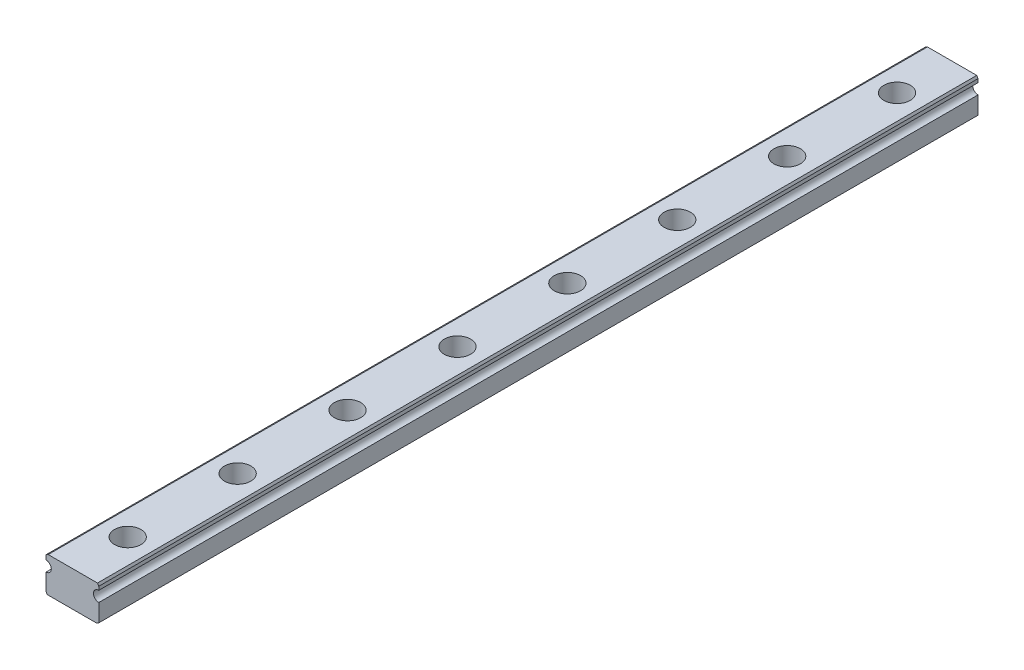
ISO-10303-21;
HEADER;
FILE_DESCRIPTION(('STEP AP214'),'2;1');
FILE_NAME('part.step','',(''),(''),'','','');
FILE_SCHEMA(('AUTOMOTIVE_DESIGN { 1 0 10303 214 1 1 1 1 }'));
ENDSEC;
DATA;
#1=APPLICATION_CONTEXT('core data for automotive mechanical design processes');
#2=APPLICATION_PROTOCOL_DEFINITION('international standard','automotive_design',2000,#1);
#3=PRODUCT_CONTEXT('',#1,'mechanical');
#4=PRODUCT('Part','Part','',(#3));
#5=PRODUCT_RELATED_PRODUCT_CATEGORY('part','',(#4));
#6=PRODUCT_DEFINITION_FORMATION('','',#4);
#7=PRODUCT_DEFINITION_CONTEXT('part definition',#1,'design');
#8=PRODUCT_DEFINITION('design','',#6,#7);
#9=PRODUCT_DEFINITION_SHAPE('','',#8);
#10=(LENGTH_UNIT() NAMED_UNIT(*) SI_UNIT(.MILLI.,.METRE.));
#11=(NAMED_UNIT(*) PLANE_ANGLE_UNIT() SI_UNIT($,.RADIAN.));
#12=(NAMED_UNIT(*) SI_UNIT($,.STERADIAN.) SOLID_ANGLE_UNIT());
#13=UNCERTAINTY_MEASURE_WITH_UNIT(LENGTH_MEASURE(1.E-05),#10,'distance_accuracy_value','');
#14=(GEOMETRIC_REPRESENTATION_CONTEXT(3) GLOBAL_UNCERTAINTY_ASSIGNED_CONTEXT((#13)) GLOBAL_UNIT_ASSIGNED_CONTEXT((#10,
#11,#12)) REPRESENTATION_CONTEXT('',''));
#15=CARTESIAN_POINT('',(0.,0.,0.));
#16=DIRECTION('',(0.,0.,1.));
#17=DIRECTION('',(1.,0.,0.));
#18=AXIS2_PLACEMENT_3D('',#15,#16,#17);
#19=CARTESIAN_POINT('',(0.0924546286147632,-4.001,-87.5));
#20=DIRECTION('',(0.,1.,0.));
#21=DIRECTION('',(0.,0.,1.));
#22=AXIS2_PLACEMENT_3D('',#19,#20,#21);
#23=CYLINDRICAL_SURFACE('',#22,1.75);
#24=CARTESIAN_POINT('',(0.0924546286147632,-4.,-87.5));
#25=DIRECTION('',(0.,1.,0.));
#26=DIRECTION('',(0.,0.,1.));
#27=AXIS2_PLACEMENT_3D('',#24,#25,#26);
#28=CIRCLE('',#27,1.75);
#29=CARTESIAN_POINT('',(0.0924546286147632,-4.,-85.75));
#30=VERTEX_POINT('',#29);
#31=EDGE_CURVE('E244',#30,#30,#28,.F.);
#32=ORIENTED_EDGE('',*,*,#31,.T.);
#33=EDGE_LOOP('',(#32));
#34=FACE_BOUND('',#33,.T.);
#35=CARTESIAN_POINT('',(0.0924546286147632,-0.5,-87.5));
#36=DIRECTION('',(0.,1.,0.));
#37=DIRECTION('',(0.,0.,1.));
#38=AXIS2_PLACEMENT_3D('',#35,#36,#37);
#39=CIRCLE('',#38,1.75);
#40=CARTESIAN_POINT('',(0.0924546286147632,-0.5,-85.75));
#41=VERTEX_POINT('',#40);
#42=EDGE_CURVE('E43',#41,#41,#39,.F.);
#43=ORIENTED_EDGE('',*,*,#42,.F.);
#44=EDGE_LOOP('',(#43));
#45=FACE_BOUND('',#44,.T.);
#46=ADVANCED_FACE('F38',(#34,#45),#23,.F.);
#47=CARTESIAN_POINT('',(0.0924546286147632,-4.001,-62.5));
#48=DIRECTION('',(0.,1.,0.));
#49=DIRECTION('',(0.,0.,1.));
#50=AXIS2_PLACEMENT_3D('',#47,#48,#49);
#51=CYLINDRICAL_SURFACE('',#50,1.75);
#52=CARTESIAN_POINT('',(0.0924546286147632,-4.,-62.5));
#53=DIRECTION('',(0.,1.,0.));
#54=DIRECTION('',(0.,0.,1.));
#55=AXIS2_PLACEMENT_3D('',#52,#53,#54);
#56=CIRCLE('',#55,1.75);
#57=CARTESIAN_POINT('',(0.0924546286147632,-4.,-60.75));
#58=VERTEX_POINT('',#57);
#59=EDGE_CURVE('E248',#58,#58,#56,.F.);
#60=ORIENTED_EDGE('',*,*,#59,.T.);
#61=EDGE_LOOP('',(#60));
#62=FACE_BOUND('',#61,.T.);
#63=CARTESIAN_POINT('',(0.0924546286147632,-0.5,-62.5));
#64=DIRECTION('',(0.,1.,0.));
#65=DIRECTION('',(0.,0.,1.));
#66=AXIS2_PLACEMENT_3D('',#63,#64,#65);
#67=CIRCLE('',#66,1.75);
#68=CARTESIAN_POINT('',(0.0924546286147632,-0.5,-60.75));
#69=VERTEX_POINT('',#68);
#70=EDGE_CURVE('E239',#69,#69,#67,.F.);
#71=ORIENTED_EDGE('',*,*,#70,.F.);
#72=EDGE_LOOP('',(#71));
#73=FACE_BOUND('',#72,.T.);
#74=ADVANCED_FACE('F321',(#62,#73),#51,.F.);
#75=CARTESIAN_POINT('',(0.0924546286147632,-4.001,-37.5));
#76=DIRECTION('',(0.,1.,0.));
#77=DIRECTION('',(0.,0.,1.));
#78=AXIS2_PLACEMENT_3D('',#75,#76,#77);
#79=CYLINDRICAL_SURFACE('',#78,1.75);
#80=CARTESIAN_POINT('',(0.0924546286147632,-4.,-37.5));
#81=DIRECTION('',(0.,1.,0.));
#82=DIRECTION('',(0.,0.,1.));
#83=AXIS2_PLACEMENT_3D('',#80,#81,#82);
#84=CIRCLE('',#83,1.75);
#85=CARTESIAN_POINT('',(0.0924546286147632,-4.,-35.75));
#86=VERTEX_POINT('',#85);
#87=EDGE_CURVE('E253',#86,#86,#84,.F.);
#88=ORIENTED_EDGE('',*,*,#87,.T.);
#89=EDGE_LOOP('',(#88));
#90=FACE_BOUND('',#89,.T.);
#91=CARTESIAN_POINT('',(0.0924546286147632,-0.5,-37.5));
#92=DIRECTION('',(0.,1.,0.));
#93=DIRECTION('',(0.,0.,1.));
#94=AXIS2_PLACEMENT_3D('',#91,#92,#93);
#95=CIRCLE('',#94,1.75);
#96=CARTESIAN_POINT('',(0.0924546286147632,-0.5,-35.75));
#97=VERTEX_POINT('',#96);
#98=EDGE_CURVE('E237',#97,#97,#95,.F.);
#99=ORIENTED_EDGE('',*,*,#98,.F.);
#100=EDGE_LOOP('',(#99));
#101=FACE_BOUND('',#100,.T.);
#102=ADVANCED_FACE('F326',(#90,#101),#79,.F.);
#103=CARTESIAN_POINT('',(0.0924546286147632,-4.001,-12.5));
#104=DIRECTION('',(0.,1.,0.));
#105=DIRECTION('',(0.,0.,1.));
#106=AXIS2_PLACEMENT_3D('',#103,#104,#105);
#107=CYLINDRICAL_SURFACE('',#106,1.75);
#108=CARTESIAN_POINT('',(0.0924546286147632,-4.,-12.5));
#109=DIRECTION('',(0.,1.,0.));
#110=DIRECTION('',(0.,0.,1.));
#111=AXIS2_PLACEMENT_3D('',#108,#109,#110);
#112=CIRCLE('',#111,1.75);
#113=CARTESIAN_POINT('',(0.0924546286147632,-4.,-10.75));
#114=VERTEX_POINT('',#113);
#115=EDGE_CURVE('E721',#114,#114,#112,.F.);
#116=ORIENTED_EDGE('',*,*,#115,.T.);
#117=EDGE_LOOP('',(#116));
#118=FACE_BOUND('',#117,.T.);
#119=CARTESIAN_POINT('',(0.0924546286147632,-0.5,-12.5));
#120=DIRECTION('',(0.,1.,0.));
#121=DIRECTION('',(0.,0.,1.));
#122=AXIS2_PLACEMENT_3D('',#119,#120,#121);
#123=CIRCLE('',#122,1.75);
#124=CARTESIAN_POINT('',(0.0924546286147632,-0.5,-10.75));
#125=VERTEX_POINT('',#124);
#126=EDGE_CURVE('E234',#125,#125,#123,.F.);
#127=ORIENTED_EDGE('',*,*,#126,.F.);
#128=EDGE_LOOP('',(#127));
#129=FACE_BOUND('',#128,.T.);
#130=ADVANCED_FACE('F605',(#118,#129),#107,.F.);
#131=CARTESIAN_POINT('',(0.0924546286147632,-4.001,12.5));
#132=DIRECTION('',(0.,1.,0.));
#133=DIRECTION('',(0.,0.,1.));
#134=AXIS2_PLACEMENT_3D('',#131,#132,#133);
#135=CYLINDRICAL_SURFACE('',#134,1.75);
#136=CARTESIAN_POINT('',(0.0924546286147632,-4.,12.5));
#137=DIRECTION('',(0.,1.,0.));
#138=DIRECTION('',(0.,0.,1.));
#139=AXIS2_PLACEMENT_3D('',#136,#137,#138);
#140=CIRCLE('',#139,1.75);
#141=CARTESIAN_POINT('',(0.0924546286147632,-4.,14.25));
#142=VERTEX_POINT('',#141);
#143=EDGE_CURVE('E713',#142,#142,#140,.F.);
#144=ORIENTED_EDGE('',*,*,#143,.T.);
#145=EDGE_LOOP('',(#144));
#146=FACE_BOUND('',#145,.T.);
#147=CARTESIAN_POINT('',(0.0924546286147632,-0.5,12.5));
#148=DIRECTION('',(0.,1.,0.));
#149=DIRECTION('',(0.,0.,1.));
#150=AXIS2_PLACEMENT_3D('',#147,#148,#149);
#151=CIRCLE('',#150,1.75);
#152=CARTESIAN_POINT('',(0.0924546286147632,-0.5,14.25));
#153=VERTEX_POINT('',#152);
#154=EDGE_CURVE('E231',#153,#153,#151,.F.);
#155=ORIENTED_EDGE('',*,*,#154,.F.);
#156=EDGE_LOOP('',(#155));
#157=FACE_BOUND('',#156,.T.);
#158=ADVANCED_FACE('F614',(#146,#157),#135,.F.);
#159=CARTESIAN_POINT('',(0.0924546286147632,-4.001,37.5));
#160=DIRECTION('',(0.,1.,0.));
#161=DIRECTION('',(0.,0.,1.));
#162=AXIS2_PLACEMENT_3D('',#159,#160,#161);
#163=CYLINDRICAL_SURFACE('',#162,1.75);
#164=CARTESIAN_POINT('',(0.0924546286147632,-4.,37.5));
#165=DIRECTION('',(0.,1.,0.));
#166=DIRECTION('',(0.,0.,1.));
#167=AXIS2_PLACEMENT_3D('',#164,#165,#166);
#168=CIRCLE('',#167,1.75);
#169=CARTESIAN_POINT('',(0.0924546286147632,-4.,39.25));
#170=VERTEX_POINT('',#169);
#171=EDGE_CURVE('E710',#170,#170,#168,.F.);
#172=ORIENTED_EDGE('',*,*,#171,.T.);
#173=EDGE_LOOP('',(#172));
#174=FACE_BOUND('',#173,.T.);
#175=CARTESIAN_POINT('',(0.0924546286147632,-0.5,37.5));
#176=DIRECTION('',(0.,1.,0.));
#177=DIRECTION('',(0.,0.,1.));
#178=AXIS2_PLACEMENT_3D('',#175,#176,#177);
#179=CIRCLE('',#178,1.75);
#180=CARTESIAN_POINT('',(0.0924546286147632,-0.5,39.25));
#181=VERTEX_POINT('',#180);
#182=EDGE_CURVE('E227',#181,#181,#179,.F.);
#183=ORIENTED_EDGE('',*,*,#182,.F.);
#184=EDGE_LOOP('',(#183));
#185=FACE_BOUND('',#184,.T.);
#186=ADVANCED_FACE('F624',(#174,#185),#163,.F.);
#187=CARTESIAN_POINT('',(0.0924546286147632,-4.001,62.5));
#188=DIRECTION('',(0.,1.,0.));
#189=DIRECTION('',(0.,0.,1.));
#190=AXIS2_PLACEMENT_3D('',#187,#188,#189);
#191=CYLINDRICAL_SURFACE('',#190,1.75);
#192=CARTESIAN_POINT('',(0.0924546286147632,-4.,62.5));
#193=DIRECTION('',(0.,1.,0.));
#194=DIRECTION('',(0.,0.,1.));
#195=AXIS2_PLACEMENT_3D('',#192,#193,#194);
#196=CIRCLE('',#195,1.75);
#197=CARTESIAN_POINT('',(0.0924546286147632,-4.,64.25));
#198=VERTEX_POINT('',#197);
#199=EDGE_CURVE('E262',#198,#198,#196,.F.);
#200=ORIENTED_EDGE('',*,*,#199,.T.);
#201=EDGE_LOOP('',(#200));
#202=FACE_BOUND('',#201,.T.);
#203=CARTESIAN_POINT('',(0.0924546286147632,-0.5,62.5));
#204=DIRECTION('',(0.,1.,0.));
#205=DIRECTION('',(0.,0.,1.));
#206=AXIS2_PLACEMENT_3D('',#203,#204,#205);
#207=CIRCLE('',#206,1.75);
#208=CARTESIAN_POINT('',(0.0924546286147632,-0.5,64.25));
#209=VERTEX_POINT('',#208);
#210=EDGE_CURVE('E224',#209,#209,#207,.F.);
#211=ORIENTED_EDGE('',*,*,#210,.F.);
#212=EDGE_LOOP('',(#211));
#213=FACE_BOUND('',#212,.T.);
#214=ADVANCED_FACE('F343',(#202,#213),#191,.F.);
#215=CARTESIAN_POINT('',(0.0924546286147632,-4.001,87.5));
#216=DIRECTION('',(0.,1.,0.));
#217=DIRECTION('',(0.,0.,1.));
#218=AXIS2_PLACEMENT_3D('',#215,#216,#217);
#219=CYLINDRICAL_SURFACE('',#218,1.75);
#220=CARTESIAN_POINT('',(0.0924546286147632,-4.,87.5));
#221=DIRECTION('',(0.,1.,0.));
#222=DIRECTION('',(0.,0.,1.));
#223=AXIS2_PLACEMENT_3D('',#220,#221,#222);
#224=CIRCLE('',#223,1.75);
#225=CARTESIAN_POINT('',(0.0924546286147632,-4.,89.25));
#226=VERTEX_POINT('',#225);
#227=EDGE_CURVE('E168',#226,#226,#224,.F.);
#228=ORIENTED_EDGE('',*,*,#227,.T.);
#229=EDGE_LOOP('',(#228));
#230=FACE_BOUND('',#229,.T.);
#231=CARTESIAN_POINT('',(0.0924546286147632,-0.5,87.5));
#232=DIRECTION('',(0.,1.,0.));
#233=DIRECTION('',(0.,0.,1.));
#234=AXIS2_PLACEMENT_3D('',#231,#232,#233);
#235=CIRCLE('',#234,1.75);
#236=CARTESIAN_POINT('',(0.0924546286147632,-0.5,89.25));
#237=VERTEX_POINT('',#236);
#238=EDGE_CURVE('E220',#237,#237,#235,.F.);
#239=ORIENTED_EDGE('',*,*,#238,.F.);
#240=EDGE_LOOP('',(#239));
#241=FACE_BOUND('',#240,.T.);
#242=ADVANCED_FACE('F316',(#230,#241),#219,.F.);
#243=CARTESIAN_POINT('',(6.,2.7,100.));
#244=DIRECTION('',(-1.,0.,0.));
#245=DIRECTION('',(0.,0.,1.));
#246=AXIS2_PLACEMENT_3D('',#243,#244,#245);
#247=PLANE('',#246);
#248=DIRECTION('',(0.,1.,0.));
#249=VECTOR('',#248,1.);
#250=CARTESIAN_POINT('',(6.,2.7,-100.));
#251=LINE('',#250,#249);
#252=CARTESIAN_POINT('',(6.,2.7,-100.));
#253=VERTEX_POINT('',#252);
#254=CARTESIAN_POINT('',(6.,3.5,-100.));
#255=VERTEX_POINT('',#254);
#256=EDGE_CURVE('E164',#253,#255,#251,.T.);
#257=ORIENTED_EDGE('',*,*,#256,.T.);
#258=DIRECTION('',(0.,0.,1.));
#259=VECTOR('',#258,1.);
#260=CARTESIAN_POINT('',(6.,3.5,100.));
#261=LINE('',#260,#259);
#262=CARTESIAN_POINT('',(6.,3.5,100.));
#263=VERTEX_POINT('',#262);
#264=EDGE_CURVE('E48',#255,#263,#261,.T.);
#265=ORIENTED_EDGE('',*,*,#264,.T.);
#266=DIRECTION('',(0.,1.,0.));
#267=VECTOR('',#266,1.);
#268=CARTESIAN_POINT('',(6.,2.7,100.));
#269=LINE('',#268,#267);
#270=CARTESIAN_POINT('',(6.,2.7,100.));
#271=VERTEX_POINT('',#270);
#272=EDGE_CURVE('E184',#271,#263,#269,.T.);
#273=ORIENTED_EDGE('',*,*,#272,.F.);
#274=DIRECTION('',(0.,0.,-1.));
#275=VECTOR('',#274,1.);
#276=CARTESIAN_POINT('',(6.,2.7,100.));
#277=LINE('',#276,#275);
#278=EDGE_CURVE('E163',#271,#253,#277,.T.);
#279=ORIENTED_EDGE('',*,*,#278,.T.);
#280=EDGE_LOOP('',(#257,#265,#273,#279));
#281=FACE_BOUND('',#280,.T.);
#282=ADVANCED_FACE('F303',(#281),#247,.F.);
#283=CARTESIAN_POINT('',(-6.,4.,100.));
#284=DIRECTION('',(0.,-1.,0.));
#285=DIRECTION('',(0.,0.,-1.));
#286=AXIS2_PLACEMENT_3D('',#283,#284,#285);
#287=PLANE('',#286);
#288=CARTESIAN_POINT('',(0.0924546286147632,4.,62.5));
#289=DIRECTION('',(0.,1.,0.));
#290=DIRECTION('',(0.,0.,1.));
#291=AXIS2_PLACEMENT_3D('',#288,#289,#290);
#292=CIRCLE('',#291,3.);
#293=CARTESIAN_POINT('',(0.0924546286147632,4.,65.5));
#294=VERTEX_POINT('',#293);
#295=EDGE_CURVE('E782',#294,#294,#292,.T.);
#296=ORIENTED_EDGE('',*,*,#295,.F.);
#297=EDGE_LOOP('',(#296));
#298=FACE_BOUND('',#297,.T.);
#299=CARTESIAN_POINT('',(0.0924546286147632,4.,37.5));
#300=DIRECTION('',(0.,1.,0.));
#301=DIRECTION('',(0.,0.,1.));
#302=AXIS2_PLACEMENT_3D('',#299,#300,#301);
#303=CIRCLE('',#302,3.);
#304=CARTESIAN_POINT('',(0.0924546286147632,4.,40.5));
#305=VERTEX_POINT('',#304);
#306=EDGE_CURVE('E776',#305,#305,#303,.T.);
#307=ORIENTED_EDGE('',*,*,#306,.F.);
#308=EDGE_LOOP('',(#307));
#309=FACE_BOUND('',#308,.T.);
#310=CARTESIAN_POINT('',(0.0924546286147632,4.,12.5));
#311=DIRECTION('',(0.,1.,0.));
#312=DIRECTION('',(0.,0.,1.));
#313=AXIS2_PLACEMENT_3D('',#310,#311,#312);
#314=CIRCLE('',#313,3.);
#315=CARTESIAN_POINT('',(0.0924546286147632,4.,15.5));
#316=VERTEX_POINT('',#315);
#317=EDGE_CURVE('E770',#316,#316,#314,.T.);
#318=ORIENTED_EDGE('',*,*,#317,.F.);
#319=EDGE_LOOP('',(#318));
#320=FACE_BOUND('',#319,.T.);
#321=CARTESIAN_POINT('',(0.0924546286147632,4.,-12.5));
#322=DIRECTION('',(0.,1.,0.));
#323=DIRECTION('',(0.,0.,1.));
#324=AXIS2_PLACEMENT_3D('',#321,#322,#323);
#325=CIRCLE('',#324,3.);
#326=CARTESIAN_POINT('',(0.0924546286147632,4.,-9.49999999999999));
#327=VERTEX_POINT('',#326);
#328=EDGE_CURVE('E764',#327,#327,#325,.T.);
#329=ORIENTED_EDGE('',*,*,#328,.F.);
#330=EDGE_LOOP('',(#329));
#331=FACE_BOUND('',#330,.T.);
#332=CARTESIAN_POINT('',(0.0924546286147632,4.,-37.5));
#333=DIRECTION('',(0.,1.,0.));
#334=DIRECTION('',(0.,0.,1.));
#335=AXIS2_PLACEMENT_3D('',#332,#333,#334);
#336=CIRCLE('',#335,3.);
#337=CARTESIAN_POINT('',(0.0924546286147632,4.,-34.5));
#338=VERTEX_POINT('',#337);
#339=EDGE_CURVE('E758',#338,#338,#336,.T.);
#340=ORIENTED_EDGE('',*,*,#339,.F.);
#341=EDGE_LOOP('',(#340));
#342=FACE_BOUND('',#341,.T.);
#343=CARTESIAN_POINT('',(0.0924546286147632,4.,-62.5));
#344=DIRECTION('',(0.,1.,0.));
#345=DIRECTION('',(0.,0.,1.));
#346=AXIS2_PLACEMENT_3D('',#343,#344,#345);
#347=CIRCLE('',#346,3.);
#348=CARTESIAN_POINT('',(0.0924546286147632,4.,-59.5));
#349=VERTEX_POINT('',#348);
#350=EDGE_CURVE('E752',#349,#349,#347,.T.);
#351=ORIENTED_EDGE('',*,*,#350,.F.);
#352=EDGE_LOOP('',(#351));
#353=FACE_BOUND('',#352,.T.);
#354=CARTESIAN_POINT('',(0.0924546286147632,4.,-87.5));
#355=DIRECTION('',(0.,1.,0.));
#356=DIRECTION('',(0.,0.,1.));
#357=AXIS2_PLACEMENT_3D('',#354,#355,#356);
#358=CIRCLE('',#357,3.);
#359=CARTESIAN_POINT('',(0.0924546286147632,4.,-84.5));
#360=VERTEX_POINT('',#359);
#361=EDGE_CURVE('E716',#360,#360,#358,.T.);
#362=ORIENTED_EDGE('',*,*,#361,.F.);
#363=EDGE_LOOP('',(#362));
#364=FACE_BOUND('',#363,.T.);
#365=CARTESIAN_POINT('',(0.0924546286147632,4.,87.5));
#366=DIRECTION('',(0.,1.,0.));
#367=DIRECTION('',(0.,0.,1.));
#368=AXIS2_PLACEMENT_3D('',#365,#366,#367);
#369=CIRCLE('',#368,3.);
#370=CARTESIAN_POINT('',(0.0924546286147632,4.,90.5));
#371=VERTEX_POINT('',#370);
#372=EDGE_CURVE('E259',#371,#371,#369,.T.);
#373=ORIENTED_EDGE('',*,*,#372,.F.);
#374=EDGE_LOOP('',(#373));
#375=FACE_BOUND('',#374,.T.);
#376=DIRECTION('',(-1.,0.,0.));
#377=VECTOR('',#376,1.);
#378=CARTESIAN_POINT('',(-6.,4.,100.));
#379=LINE('',#378,#377);
#380=CARTESIAN_POINT('',(5.71132486540518,4.,100.));
#381=VERTEX_POINT('',#380);
#382=CARTESIAN_POINT('',(-5.5,4.,100.));
#383=VERTEX_POINT('',#382);
#384=EDGE_CURVE('E137',#381,#383,#379,.T.);
#385=ORIENTED_EDGE('',*,*,#384,.F.);
#386=DIRECTION('',(0.,0.,-1.));
#387=VECTOR('',#386,1.);
#388=CARTESIAN_POINT('',(5.71132486540518,4.,100.));
#389=LINE('',#388,#387);
#390=CARTESIAN_POINT('',(5.71132486540518,4.,-100.));
#391=VERTEX_POINT('',#390);
#392=EDGE_CURVE('E216',#381,#391,#389,.T.);
#393=ORIENTED_EDGE('',*,*,#392,.T.);
#394=DIRECTION('',(-1.,0.,0.));
#395=VECTOR('',#394,1.);
#396=CARTESIAN_POINT('',(-6.,4.,-100.));
#397=LINE('',#396,#395);
#398=CARTESIAN_POINT('',(-5.5,4.,-100.));
#399=VERTEX_POINT('',#398);
#400=EDGE_CURVE('E167',#391,#399,#397,.T.);
#401=ORIENTED_EDGE('',*,*,#400,.T.);
#402=DIRECTION('',(0.,0.,1.));
#403=VECTOR('',#402,1.);
#404=CARTESIAN_POINT('',(-5.5,4.,100.));
#405=LINE('',#404,#403);
#406=EDGE_CURVE('E214',#399,#383,#405,.T.);
#407=ORIENTED_EDGE('',*,*,#406,.T.);
#408=EDGE_LOOP('',(#385,#393,#401,#407));
#409=FACE_BOUND('',#408,.T.);
#410=ADVANCED_FACE('F307',(#298,#309,#320,#331,#342,#353,#364,#375,#409),#287,.F.);
#411=CARTESIAN_POINT('',(-6.,2.7,100.));
#412=DIRECTION('',(1.,0.,0.));
#413=DIRECTION('',(0.,0.,-1.));
#414=AXIS2_PLACEMENT_3D('',#411,#412,#413);
#415=PLANE('',#414);
#416=DIRECTION('',(0.,-1.,0.));
#417=VECTOR('',#416,1.);
#418=CARTESIAN_POINT('',(-6.,2.7,100.));
#419=LINE('',#418,#417);
#420=CARTESIAN_POINT('',(-6.,3.71132486540519,100.));
#421=VERTEX_POINT('',#420);
#422=CARTESIAN_POINT('',(-6.,2.7,100.));
#423=VERTEX_POINT('',#422);
#424=EDGE_CURVE('E128',#421,#423,#419,.T.);
#425=ORIENTED_EDGE('',*,*,#424,.F.);
#426=DIRECTION('',(0.,0.,-1.));
#427=VECTOR('',#426,1.);
#428=CARTESIAN_POINT('',(-6.,3.71132486540519,100.));
#429=LINE('',#428,#427);
#430=CARTESIAN_POINT('',(-6.,3.71132486540519,-100.));
#431=VERTEX_POINT('',#430);
#432=EDGE_CURVE('E11',#421,#431,#429,.T.);
#433=ORIENTED_EDGE('',*,*,#432,.T.);
#434=DIRECTION('',(0.,-1.,0.));
#435=VECTOR('',#434,1.);
#436=CARTESIAN_POINT('',(-6.,2.7,-100.));
#437=LINE('',#436,#435);
#438=CARTESIAN_POINT('',(-6.,2.7,-100.));
#439=VERTEX_POINT('',#438);
#440=EDGE_CURVE('E143',#431,#439,#437,.T.);
#441=ORIENTED_EDGE('',*,*,#440,.T.);
#442=DIRECTION('',(0.,0.,-1.));
#443=VECTOR('',#442,1.);
#444=CARTESIAN_POINT('',(-6.,2.7,100.));
#445=LINE('',#444,#443);
#446=EDGE_CURVE('E140',#423,#439,#445,.T.);
#447=ORIENTED_EDGE('',*,*,#446,.F.);
#448=EDGE_LOOP('',(#425,#433,#441,#447));
#449=FACE_BOUND('',#448,.T.);
#450=ADVANCED_FACE('F141',(#449),#415,.F.);
#451=CARTESIAN_POINT('',(-6.,1.5,100.));
#452=DIRECTION('',(0.,0.,-1.));
#453=DIRECTION('',(-1.,0.,0.));
#454=AXIS2_PLACEMENT_3D('',#451,#452,#453);
#455=CYLINDRICAL_SURFACE('',#454,1.2);
#456=CARTESIAN_POINT('',(-6.,1.5,-100.));
#457=DIRECTION('',(0.,0.,-1.));
#458=DIRECTION('',(1.,0.,0.));
#459=AXIS2_PLACEMENT_3D('',#456,#457,#458);
#460=CIRCLE('',#459,1.2);
#461=CARTESIAN_POINT('',(-6.,0.3,-100.));
#462=VERTEX_POINT('',#461);
#463=EDGE_CURVE('E172',#439,#462,#460,.T.);
#464=ORIENTED_EDGE('',*,*,#463,.T.);
#465=DIRECTION('',(0.,0.,-1.));
#466=VECTOR('',#465,1.);
#467=CARTESIAN_POINT('',(-6.,0.3,100.));
#468=LINE('',#467,#466);
#469=CARTESIAN_POINT('',(-6.,0.3,100.));
#470=VERTEX_POINT('',#469);
#471=EDGE_CURVE('E147',#470,#462,#468,.T.);
#472=ORIENTED_EDGE('',*,*,#471,.F.);
#473=CARTESIAN_POINT('',(-6.,1.5,100.));
#474=DIRECTION('',(0.,0.,-1.));
#475=DIRECTION('',(1.,0.,0.));
#476=AXIS2_PLACEMENT_3D('',#473,#474,#475);
#477=CIRCLE('',#476,1.2);
#478=EDGE_CURVE('E133',#423,#470,#477,.T.);
#479=ORIENTED_EDGE('',*,*,#478,.F.);
#480=ORIENTED_EDGE('',*,*,#446,.T.);
#481=EDGE_LOOP('',(#464,#472,#479,#480));
#482=FACE_BOUND('',#481,.T.);
#483=ADVANCED_FACE('F149',(#482),#455,.F.);
#484=CARTESIAN_POINT('',(-6.,-4.,100.));
#485=DIRECTION('',(1.,0.,0.));
#486=DIRECTION('',(0.,0.,-1.));
#487=AXIS2_PLACEMENT_3D('',#484,#485,#486);
#488=PLANE('',#487);
#489=DIRECTION('',(0.,-1.,0.));
#490=VECTOR('',#489,1.);
#491=CARTESIAN_POINT('',(-6.,-4.,-100.));
#492=LINE('',#491,#490);
#493=CARTESIAN_POINT('',(-6.,-3.5,-100.));
#494=VERTEX_POINT('',#493);
#495=EDGE_CURVE('E174',#462,#494,#492,.T.);
#496=ORIENTED_EDGE('',*,*,#495,.T.);
#497=DIRECTION('',(0.,0.,1.));
#498=VECTOR('',#497,1.);
#499=CARTESIAN_POINT('',(-6.,-3.5,100.));
#500=LINE('',#499,#498);
#501=CARTESIAN_POINT('',(-6.,-3.5,100.));
#502=VERTEX_POINT('',#501);
#503=EDGE_CURVE('E203',#494,#502,#500,.T.);
#504=ORIENTED_EDGE('',*,*,#503,.T.);
#505=DIRECTION('',(0.,-1.,0.));
#506=VECTOR('',#505,1.);
#507=CARTESIAN_POINT('',(-6.,-4.,100.));
#508=LINE('',#507,#506);
#509=EDGE_CURVE('E152',#470,#502,#508,.T.);
#510=ORIENTED_EDGE('',*,*,#509,.F.);
#511=ORIENTED_EDGE('',*,*,#471,.T.);
#512=EDGE_LOOP('',(#496,#504,#510,#511));
#513=FACE_BOUND('',#512,.T.);
#514=ADVANCED_FACE('F278',(#513),#488,.F.);
#515=CARTESIAN_POINT('',(-6.,-4.,100.));
#516=DIRECTION('',(0.,1.,0.));
#517=DIRECTION('',(0.,0.,1.));
#518=AXIS2_PLACEMENT_3D('',#515,#516,#517);
#519=PLANE('',#518);
#520=ORIENTED_EDGE('',*,*,#199,.F.);
#521=EDGE_LOOP('',(#520));
#522=FACE_BOUND('',#521,.T.);
#523=ORIENTED_EDGE('',*,*,#171,.F.);
#524=EDGE_LOOP('',(#523));
#525=FACE_BOUND('',#524,.T.);
#526=ORIENTED_EDGE('',*,*,#143,.F.);
#527=EDGE_LOOP('',(#526));
#528=FACE_BOUND('',#527,.T.);
#529=ORIENTED_EDGE('',*,*,#115,.F.);
#530=EDGE_LOOP('',(#529));
#531=FACE_BOUND('',#530,.T.);
#532=ORIENTED_EDGE('',*,*,#87,.F.);
#533=EDGE_LOOP('',(#532));
#534=FACE_BOUND('',#533,.T.);
#535=ORIENTED_EDGE('',*,*,#59,.F.);
#536=EDGE_LOOP('',(#535));
#537=FACE_BOUND('',#536,.T.);
#538=ORIENTED_EDGE('',*,*,#31,.F.);
#539=EDGE_LOOP('',(#538));
#540=FACE_BOUND('',#539,.T.);
#541=ORIENTED_EDGE('',*,*,#227,.F.);
#542=EDGE_LOOP('',(#541));
#543=FACE_BOUND('',#542,.T.);
#544=DIRECTION('',(1.,0.,0.));
#545=VECTOR('',#544,1.);
#546=CARTESIAN_POINT('',(-6.,-4.,100.));
#547=LINE('',#546,#545);
#548=CARTESIAN_POINT('',(-5.71132486540519,-4.,100.));
#549=VERTEX_POINT('',#548);
#550=CARTESIAN_POINT('',(5.5,-4.,100.));
#551=VERTEX_POINT('',#550);
#552=EDGE_CURVE('E154',#549,#551,#547,.T.);
#553=ORIENTED_EDGE('',*,*,#552,.F.);
#554=DIRECTION('',(0.,0.,-1.));
#555=VECTOR('',#554,1.);
#556=CARTESIAN_POINT('',(-5.71132486540519,-4.,100.));
#557=LINE('',#556,#555);
#558=CARTESIAN_POINT('',(-5.71132486540519,-4.,-100.));
#559=VERTEX_POINT('',#558);
#560=EDGE_CURVE('E192',#549,#559,#557,.T.);
#561=ORIENTED_EDGE('',*,*,#560,.T.);
#562=DIRECTION('',(1.,0.,0.));
#563=VECTOR('',#562,1.);
#564=CARTESIAN_POINT('',(-6.,-4.,-100.));
#565=LINE('',#564,#563);
#566=CARTESIAN_POINT('',(5.5,-4.,-100.));
#567=VERTEX_POINT('',#566);
#568=EDGE_CURVE('E177',#559,#567,#565,.T.);
#569=ORIENTED_EDGE('',*,*,#568,.T.);
#570=DIRECTION('',(0.,0.,1.));
#571=VECTOR('',#570,1.);
#572=CARTESIAN_POINT('',(5.5,-4.,100.));
#573=LINE('',#572,#571);
#574=EDGE_CURVE('E146',#567,#551,#573,.T.);
#575=ORIENTED_EDGE('',*,*,#574,.T.);
#576=EDGE_LOOP('',(#553,#561,#569,#575));
#577=FACE_BOUND('',#576,.T.);
#578=ADVANCED_FACE('F286',(#522,#525,#528,#531,#534,#537,#540,#543,#577),#519,.F.);
#579=CARTESIAN_POINT('',(6.,-4.,100.));
#580=DIRECTION('',(-1.,0.,0.));
#581=DIRECTION('',(0.,0.,1.));
#582=AXIS2_PLACEMENT_3D('',#579,#580,#581);
#583=PLANE('',#582);
#584=DIRECTION('',(0.,1.,0.));
#585=VECTOR('',#584,1.);
#586=CARTESIAN_POINT('',(6.,-4.,100.));
#587=LINE('',#586,#585);
#588=CARTESIAN_POINT('',(6.,-3.71132486540519,100.));
#589=VERTEX_POINT('',#588);
#590=CARTESIAN_POINT('',(6.,0.3,100.));
#591=VERTEX_POINT('',#590);
#592=EDGE_CURVE('E159',#589,#591,#587,.T.);
#593=ORIENTED_EDGE('',*,*,#592,.F.);
#594=DIRECTION('',(0.,0.,-1.));
#595=VECTOR('',#594,1.);
#596=CARTESIAN_POINT('',(6.,-3.71132486540519,100.));
#597=LINE('',#596,#595);
#598=CARTESIAN_POINT('',(6.,-3.71132486540519,-100.));
#599=VERTEX_POINT('',#598);
#600=EDGE_CURVE('E211',#589,#599,#597,.T.);
#601=ORIENTED_EDGE('',*,*,#600,.T.);
#602=DIRECTION('',(0.,1.,0.));
#603=VECTOR('',#602,1.);
#604=CARTESIAN_POINT('',(6.,-4.,-100.));
#605=LINE('',#604,#603);
#606=CARTESIAN_POINT('',(6.,0.3,-100.));
#607=VERTEX_POINT('',#606);
#608=EDGE_CURVE('E180',#599,#607,#605,.T.);
#609=ORIENTED_EDGE('',*,*,#608,.T.);
#610=DIRECTION('',(0.,0.,-1.));
#611=VECTOR('',#610,1.);
#612=CARTESIAN_POINT('',(6.,0.3,100.));
#613=LINE('',#612,#611);
#614=EDGE_CURVE('E187',#591,#607,#613,.T.);
#615=ORIENTED_EDGE('',*,*,#614,.F.);
#616=EDGE_LOOP('',(#593,#601,#609,#615));
#617=FACE_BOUND('',#616,.T.);
#618=ADVANCED_FACE('F294',(#617),#583,.F.);
#619=CARTESIAN_POINT('',(6.,1.5,100.));
#620=DIRECTION('',(0.,0.,-1.));
#621=DIRECTION('',(-1.,0.,0.));
#622=AXIS2_PLACEMENT_3D('',#619,#620,#621);
#623=CYLINDRICAL_SURFACE('',#622,1.2);
#624=CARTESIAN_POINT('',(6.,1.5,-100.));
#625=DIRECTION('',(0.,0.,-1.));
#626=DIRECTION('',(-1.,0.,0.));
#627=AXIS2_PLACEMENT_3D('',#624,#625,#626);
#628=CIRCLE('',#627,1.2);
#629=EDGE_CURVE('E182',#607,#253,#628,.T.);
#630=ORIENTED_EDGE('',*,*,#629,.T.);
#631=ORIENTED_EDGE('',*,*,#278,.F.);
#632=CARTESIAN_POINT('',(6.,1.5,100.));
#633=DIRECTION('',(0.,0.,-1.));
#634=DIRECTION('',(-1.,0.,0.));
#635=AXIS2_PLACEMENT_3D('',#632,#633,#634);
#636=CIRCLE('',#635,1.2);
#637=EDGE_CURVE('E161',#591,#271,#636,.T.);
#638=ORIENTED_EDGE('',*,*,#637,.F.);
#639=ORIENTED_EDGE('',*,*,#614,.T.);
#640=EDGE_LOOP('',(#630,#631,#638,#639));
#641=FACE_BOUND('',#640,.T.);
#642=ADVANCED_FACE('F300',(#641),#623,.F.);
#643=CARTESIAN_POINT('',(-6.,1.5,100.));
#644=DIRECTION('',(0.,0.,1.));
#645=DIRECTION('',(1.,0.,0.));
#646=AXIS2_PLACEMENT_3D('',#643,#644,#645);
#647=PLANE('',#646);
#648=ORIENTED_EDGE('',*,*,#509,.T.);
#649=DIRECTION('',(-0.499999999999996,0.866025403784441,0.));
#650=VECTOR('',#649,1.);
#651=CARTESIAN_POINT('',(-8.16506350946108,0.250000000000022,100.));
#652=LINE('',#651,#650);
#653=EDGE_CURVE('E209',#502,#549,#652,.F.);
#654=ORIENTED_EDGE('',*,*,#653,.T.);
#655=ORIENTED_EDGE('',*,*,#552,.T.);
#656=DIRECTION('',(-0.866025403784441,-0.499999999999996,0.));
#657=VECTOR('',#656,1.);
#658=CARTESIAN_POINT('',(-0.743430139592861,-7.60464607176052,100.));
#659=LINE('',#658,#657);
#660=EDGE_CURVE('E56',#551,#589,#659,.F.);
#661=ORIENTED_EDGE('',*,*,#660,.T.);
#662=ORIENTED_EDGE('',*,*,#592,.T.);
#663=ORIENTED_EDGE('',*,*,#637,.T.);
#664=ORIENTED_EDGE('',*,*,#272,.T.);
#665=DIRECTION('',(0.500000000000014,-0.866025403784431,0.));
#666=VECTOR('',#665,1.);
#667=CARTESIAN_POINT('',(3.86602540378429,7.19615242270675,100.));
#668=LINE('',#667,#666);
#669=EDGE_CURVE('E206',#263,#381,#668,.F.);
#670=ORIENTED_EDGE('',*,*,#669,.T.);
#671=ORIENTED_EDGE('',*,*,#384,.T.);
#672=DIRECTION('',(0.866025403784441,0.499999999999996,0.));
#673=VECTOR('',#672,1.);
#674=CARTESIAN_POINT('',(-6.95753175473055,3.1584936490539,100.));
#675=LINE('',#674,#673);
#676=EDGE_CURVE('E63',#383,#421,#675,.F.);
#677=ORIENTED_EDGE('',*,*,#676,.T.);
#678=ORIENTED_EDGE('',*,*,#424,.T.);
#679=ORIENTED_EDGE('',*,*,#478,.T.);
#680=EDGE_LOOP('',(#648,#654,#655,#661,#662,#663,#664,#670,#671,#677,#678,#679));
#681=FACE_BOUND('',#680,.T.);
#682=ADVANCED_FACE('F131',(#681),#647,.T.);
#683=CARTESIAN_POINT('',(-6.,1.5,-100.));
#684=DIRECTION('',(0.,0.,1.));
#685=DIRECTION('',(1.,0.,0.));
#686=AXIS2_PLACEMENT_3D('',#683,#684,#685);
#687=PLANE('',#686);
#688=ORIENTED_EDGE('',*,*,#568,.F.);
#689=DIRECTION('',(0.499999999999996,-0.866025403784441,0.));
#690=VECTOR('',#689,1.);
#691=CARTESIAN_POINT('',(-5.71132486540519,-4.,-100.));
#692=LINE('',#691,#690);
#693=EDGE_CURVE('E201',#559,#494,#692,.F.);
#694=ORIENTED_EDGE('',*,*,#693,.T.);
#695=ORIENTED_EDGE('',*,*,#495,.F.);
#696=ORIENTED_EDGE('',*,*,#463,.F.);
#697=ORIENTED_EDGE('',*,*,#440,.F.);
#698=DIRECTION('',(-0.866025403784441,-0.499999999999996,0.));
#699=VECTOR('',#698,1.);
#700=CARTESIAN_POINT('',(-6.,3.71132486540519,-100.));
#701=LINE('',#700,#699);
#702=EDGE_CURVE('E195',#431,#399,#701,.F.);
#703=ORIENTED_EDGE('',*,*,#702,.T.);
#704=ORIENTED_EDGE('',*,*,#400,.F.);
#705=DIRECTION('',(-0.500000000000014,0.866025403784431,0.));
#706=VECTOR('',#705,1.);
#707=CARTESIAN_POINT('',(5.71132486540518,4.,-100.));
#708=LINE('',#707,#706);
#709=EDGE_CURVE('E197',#391,#255,#708,.F.);
#710=ORIENTED_EDGE('',*,*,#709,.T.);
#711=ORIENTED_EDGE('',*,*,#256,.F.);
#712=ORIENTED_EDGE('',*,*,#629,.F.);
#713=ORIENTED_EDGE('',*,*,#608,.F.);
#714=DIRECTION('',(0.866025403784441,0.499999999999996,0.));
#715=VECTOR('',#714,1.);
#716=CARTESIAN_POINT('',(6.,-3.71132486540519,-100.));
#717=LINE('',#716,#715);
#718=EDGE_CURVE('E199',#599,#567,#717,.F.);
#719=ORIENTED_EDGE('',*,*,#718,.T.);
#720=EDGE_LOOP('',(#688,#694,#695,#696,#697,#703,#704,#710,#711,#712,#713,#719));
#721=FACE_BOUND('',#720,.T.);
#722=ADVANCED_FACE('F274',(#721),#687,.F.);
#723=CARTESIAN_POINT('',(-5.71132486540519,-4.,100.));
#724=DIRECTION('',(0.866025403784441,0.499999999999996,0.));
#725=DIRECTION('',(0.,0.,-1.));
#726=AXIS2_PLACEMENT_3D('',#723,#724,#725);
#727=PLANE('',#726);
#728=ORIENTED_EDGE('',*,*,#653,.F.);
#729=ORIENTED_EDGE('',*,*,#503,.F.);
#730=ORIENTED_EDGE('',*,*,#693,.F.);
#731=ORIENTED_EDGE('',*,*,#560,.F.);
#732=EDGE_LOOP('',(#728,#729,#730,#731));
#733=FACE_BOUND('',#732,.T.);
#734=ADVANCED_FACE('F284',(#733),#727,.F.);
#735=CARTESIAN_POINT('',(6.,-3.71132486540519,100.));
#736=DIRECTION('',(-0.499999999999996,0.866025403784441,0.));
#737=DIRECTION('',(0.,0.,-1.));
#738=AXIS2_PLACEMENT_3D('',#735,#736,#737);
#739=PLANE('',#738);
#740=ORIENTED_EDGE('',*,*,#660,.F.);
#741=ORIENTED_EDGE('',*,*,#574,.F.);
#742=ORIENTED_EDGE('',*,*,#718,.F.);
#743=ORIENTED_EDGE('',*,*,#600,.F.);
#744=EDGE_LOOP('',(#740,#741,#742,#743));
#745=FACE_BOUND('',#744,.T.);
#746=ADVANCED_FACE('F292',(#745),#739,.F.);
#747=CARTESIAN_POINT('',(5.71132486540518,4.,100.));
#748=DIRECTION('',(-0.866025403784431,-0.500000000000014,0.));
#749=DIRECTION('',(0.,0.,-1.));
#750=AXIS2_PLACEMENT_3D('',#747,#748,#749);
#751=PLANE('',#750);
#752=ORIENTED_EDGE('',*,*,#669,.F.);
#753=ORIENTED_EDGE('',*,*,#264,.F.);
#754=ORIENTED_EDGE('',*,*,#709,.F.);
#755=ORIENTED_EDGE('',*,*,#392,.F.);
#756=EDGE_LOOP('',(#752,#753,#754,#755));
#757=FACE_BOUND('',#756,.T.);
#758=ADVANCED_FACE('F306',(#757),#751,.F.);
#759=CARTESIAN_POINT('',(-6.,3.71132486540519,100.));
#760=DIRECTION('',(0.499999999999996,-0.866025403784441,0.));
#761=DIRECTION('',(0.,0.,-1.));
#762=AXIS2_PLACEMENT_3D('',#759,#760,#761);
#763=PLANE('',#762);
#764=ORIENTED_EDGE('',*,*,#676,.F.);
#765=ORIENTED_EDGE('',*,*,#406,.F.);
#766=ORIENTED_EDGE('',*,*,#702,.F.);
#767=ORIENTED_EDGE('',*,*,#432,.F.);
#768=EDGE_LOOP('',(#764,#765,#766,#767));
#769=FACE_BOUND('',#768,.T.);
#770=ADVANCED_FACE('F41',(#769),#763,.F.);
#771=CARTESIAN_POINT('',(0.0924546286147632,-0.5,87.5));
#772=DIRECTION('',(0.,1.,0.));
#773=DIRECTION('',(0.,0.,1.));
#774=AXIS2_PLACEMENT_3D('',#771,#772,#773);
#775=PLANE('',#774);
#776=CARTESIAN_POINT('',(0.0924546286147632,-0.5,87.5));
#777=DIRECTION('',(0.,1.,0.));
#778=DIRECTION('',(0.,0.,1.));
#779=AXIS2_PLACEMENT_3D('',#776,#777,#778);
#780=CIRCLE('',#779,3.);
#781=CARTESIAN_POINT('',(0.0924546286147632,-0.5,90.5));
#782=VERTEX_POINT('',#781);
#783=EDGE_CURVE('E223',#782,#782,#780,.T.);
#784=ORIENTED_EDGE('',*,*,#783,.T.);
#785=EDGE_LOOP('',(#784));
#786=FACE_BOUND('',#785,.T.);
#787=ORIENTED_EDGE('',*,*,#238,.T.);
#788=EDGE_LOOP('',(#787));
#789=FACE_BOUND('',#788,.T.);
#790=ADVANCED_FACE('F332',(#786,#789),#775,.T.);
#791=CARTESIAN_POINT('',(0.0924546286147632,-0.5,87.5));
#792=DIRECTION('',(0.,1.,0.));
#793=DIRECTION('',(0.,0.,1.));
#794=AXIS2_PLACEMENT_3D('',#791,#792,#793);
#795=CYLINDRICAL_SURFACE('',#794,3.);
#796=ORIENTED_EDGE('',*,*,#783,.F.);
#797=EDGE_LOOP('',(#796));
#798=FACE_BOUND('',#797,.T.);
#799=ORIENTED_EDGE('',*,*,#372,.T.);
#800=EDGE_LOOP('',(#799));
#801=FACE_BOUND('',#800,.T.);
#802=ADVANCED_FACE('F335',(#798,#801),#795,.F.);
#803=CARTESIAN_POINT('',(0.0924546286147632,-0.5,62.5));
#804=DIRECTION('',(0.,1.,0.));
#805=DIRECTION('',(0.,0.,1.));
#806=AXIS2_PLACEMENT_3D('',#803,#804,#805);
#807=PLANE('',#806);
#808=CARTESIAN_POINT('',(0.0924546286147632,-0.5,62.5));
#809=DIRECTION('',(0.,1.,0.));
#810=DIRECTION('',(0.,0.,1.));
#811=AXIS2_PLACEMENT_3D('',#808,#809,#810);
#812=CIRCLE('',#811,3.);
#813=CARTESIAN_POINT('',(0.0924546286147632,-0.5,65.5));
#814=VERTEX_POINT('',#813);
#815=EDGE_CURVE('E228',#814,#814,#812,.T.);
#816=ORIENTED_EDGE('',*,*,#815,.T.);
#817=EDGE_LOOP('',(#816));
#818=FACE_BOUND('',#817,.T.);
#819=ORIENTED_EDGE('',*,*,#210,.T.);
#820=EDGE_LOOP('',(#819));
#821=FACE_BOUND('',#820,.T.);
#822=ADVANCED_FACE('F339',(#818,#821),#807,.T.);
#823=CARTESIAN_POINT('',(0.0924546286147632,-0.5,62.5));
#824=DIRECTION('',(0.,1.,0.));
#825=DIRECTION('',(0.,0.,1.));
#826=AXIS2_PLACEMENT_3D('',#823,#824,#825);
#827=CYLINDRICAL_SURFACE('',#826,3.);
#828=ORIENTED_EDGE('',*,*,#815,.F.);
#829=EDGE_LOOP('',(#828));
#830=FACE_BOUND('',#829,.T.);
#831=ORIENTED_EDGE('',*,*,#295,.T.);
#832=EDGE_LOOP('',(#831));
#833=FACE_BOUND('',#832,.T.);
#834=ADVANCED_FACE('F427',(#830,#833),#827,.F.);
#835=CARTESIAN_POINT('',(0.0924546286147632,-0.5,37.5));
#836=DIRECTION('',(0.,1.,0.));
#837=DIRECTION('',(0.,0.,1.));
#838=AXIS2_PLACEMENT_3D('',#835,#836,#837);
#839=PLANE('',#838);
#840=CARTESIAN_POINT('',(0.0924546286147632,-0.5,37.5));
#841=DIRECTION('',(0.,1.,0.));
#842=DIRECTION('',(0.,0.,1.));
#843=AXIS2_PLACEMENT_3D('',#840,#841,#842);
#844=CIRCLE('',#843,3.);
#845=CARTESIAN_POINT('',(0.0924546286147632,-0.5,40.5));
#846=VERTEX_POINT('',#845);
#847=EDGE_CURVE('E779',#846,#846,#844,.T.);
#848=ORIENTED_EDGE('',*,*,#847,.T.);
#849=EDGE_LOOP('',(#848));
#850=FACE_BOUND('',#849,.T.);
#851=ORIENTED_EDGE('',*,*,#182,.T.);
#852=EDGE_LOOP('',(#851));
#853=FACE_BOUND('',#852,.T.);
#854=ADVANCED_FACE('F436',(#850,#853),#839,.T.);
#855=CARTESIAN_POINT('',(0.0924546286147632,-0.5,37.5));
#856=DIRECTION('',(0.,1.,0.));
#857=DIRECTION('',(0.,0.,1.));
#858=AXIS2_PLACEMENT_3D('',#855,#856,#857);
#859=CYLINDRICAL_SURFACE('',#858,3.);
#860=ORIENTED_EDGE('',*,*,#847,.F.);
#861=EDGE_LOOP('',(#860));
#862=FACE_BOUND('',#861,.T.);
#863=ORIENTED_EDGE('',*,*,#306,.T.);
#864=EDGE_LOOP('',(#863));
#865=FACE_BOUND('',#864,.T.);
#866=ADVANCED_FACE('F444',(#862,#865),#859,.F.);
#867=CARTESIAN_POINT('',(0.0924546286147632,-0.5,12.5));
#868=DIRECTION('',(0.,1.,0.));
#869=DIRECTION('',(0.,0.,1.));
#870=AXIS2_PLACEMENT_3D('',#867,#868,#869);
#871=PLANE('',#870);
#872=CARTESIAN_POINT('',(0.0924546286147632,-0.5,12.5));
#873=DIRECTION('',(0.,1.,0.));
#874=DIRECTION('',(0.,0.,1.));
#875=AXIS2_PLACEMENT_3D('',#872,#873,#874);
#876=CIRCLE('',#875,3.);
#877=CARTESIAN_POINT('',(0.0924546286147632,-0.5,15.5));
#878=VERTEX_POINT('',#877);
#879=EDGE_CURVE('E773',#878,#878,#876,.T.);
#880=ORIENTED_EDGE('',*,*,#879,.T.);
#881=EDGE_LOOP('',(#880));
#882=FACE_BOUND('',#881,.T.);
#883=ORIENTED_EDGE('',*,*,#154,.T.);
#884=EDGE_LOOP('',(#883));
#885=FACE_BOUND('',#884,.T.);
#886=ADVANCED_FACE('F452',(#882,#885),#871,.T.);
#887=CARTESIAN_POINT('',(0.0924546286147632,-0.5,12.5));
#888=DIRECTION('',(0.,1.,0.));
#889=DIRECTION('',(0.,0.,1.));
#890=AXIS2_PLACEMENT_3D('',#887,#888,#889);
#891=CYLINDRICAL_SURFACE('',#890,3.);
#892=ORIENTED_EDGE('',*,*,#879,.F.);
#893=EDGE_LOOP('',(#892));
#894=FACE_BOUND('',#893,.T.);
#895=ORIENTED_EDGE('',*,*,#317,.T.);
#896=EDGE_LOOP('',(#895));
#897=FACE_BOUND('',#896,.T.);
#898=ADVANCED_FACE('F460',(#894,#897),#891,.F.);
#899=CARTESIAN_POINT('',(0.0924546286147632,-0.5,-12.5));
#900=DIRECTION('',(0.,1.,0.));
#901=DIRECTION('',(0.,0.,1.));
#902=AXIS2_PLACEMENT_3D('',#899,#900,#901);
#903=PLANE('',#902);
#904=CARTESIAN_POINT('',(0.0924546286147632,-0.5,-12.5));
#905=DIRECTION('',(0.,1.,0.));
#906=DIRECTION('',(0.,0.,1.));
#907=AXIS2_PLACEMENT_3D('',#904,#905,#906);
#908=CIRCLE('',#907,3.);
#909=CARTESIAN_POINT('',(0.0924546286147632,-0.5,-9.49999999999999));
#910=VERTEX_POINT('',#909);
#911=EDGE_CURVE('E767',#910,#910,#908,.T.);
#912=ORIENTED_EDGE('',*,*,#911,.T.);
#913=EDGE_LOOP('',(#912));
#914=FACE_BOUND('',#913,.T.);
#915=ORIENTED_EDGE('',*,*,#126,.T.);
#916=EDGE_LOOP('',(#915));
#917=FACE_BOUND('',#916,.T.);
#918=ADVANCED_FACE('F468',(#914,#917),#903,.T.);
#919=CARTESIAN_POINT('',(0.0924546286147632,-0.5,-12.5));
#920=DIRECTION('',(0.,1.,0.));
#921=DIRECTION('',(0.,0.,1.));
#922=AXIS2_PLACEMENT_3D('',#919,#920,#921);
#923=CYLINDRICAL_SURFACE('',#922,3.);
#924=ORIENTED_EDGE('',*,*,#911,.F.);
#925=EDGE_LOOP('',(#924));
#926=FACE_BOUND('',#925,.T.);
#927=ORIENTED_EDGE('',*,*,#328,.T.);
#928=EDGE_LOOP('',(#927));
#929=FACE_BOUND('',#928,.T.);
#930=ADVANCED_FACE('F476',(#926,#929),#923,.F.);
#931=CARTESIAN_POINT('',(0.0924546286147632,-0.5,-37.5));
#932=DIRECTION('',(0.,1.,0.));
#933=DIRECTION('',(0.,0.,1.));
#934=AXIS2_PLACEMENT_3D('',#931,#932,#933);
#935=PLANE('',#934);
#936=CARTESIAN_POINT('',(0.0924546286147632,-0.5,-37.5));
#937=DIRECTION('',(0.,1.,0.));
#938=DIRECTION('',(0.,0.,1.));
#939=AXIS2_PLACEMENT_3D('',#936,#937,#938);
#940=CIRCLE('',#939,3.);
#941=CARTESIAN_POINT('',(0.0924546286147632,-0.5,-34.5));
#942=VERTEX_POINT('',#941);
#943=EDGE_CURVE('E761',#942,#942,#940,.T.);
#944=ORIENTED_EDGE('',*,*,#943,.T.);
#945=EDGE_LOOP('',(#944));
#946=FACE_BOUND('',#945,.T.);
#947=ORIENTED_EDGE('',*,*,#98,.T.);
#948=EDGE_LOOP('',(#947));
#949=FACE_BOUND('',#948,.T.);
#950=ADVANCED_FACE('F484',(#946,#949),#935,.T.);
#951=CARTESIAN_POINT('',(0.0924546286147632,-0.5,-37.5));
#952=DIRECTION('',(0.,1.,0.));
#953=DIRECTION('',(0.,0.,1.));
#954=AXIS2_PLACEMENT_3D('',#951,#952,#953);
#955=CYLINDRICAL_SURFACE('',#954,3.);
#956=ORIENTED_EDGE('',*,*,#943,.F.);
#957=EDGE_LOOP('',(#956));
#958=FACE_BOUND('',#957,.T.);
#959=ORIENTED_EDGE('',*,*,#339,.T.);
#960=EDGE_LOOP('',(#959));
#961=FACE_BOUND('',#960,.T.);
#962=ADVANCED_FACE('F492',(#958,#961),#955,.F.);
#963=CARTESIAN_POINT('',(0.0924546286147632,-0.5,-62.5));
#964=DIRECTION('',(0.,1.,0.));
#965=DIRECTION('',(0.,0.,1.));
#966=AXIS2_PLACEMENT_3D('',#963,#964,#965);
#967=PLANE('',#966);
#968=CARTESIAN_POINT('',(0.0924546286147632,-0.5,-62.5));
#969=DIRECTION('',(0.,1.,0.));
#970=DIRECTION('',(0.,0.,1.));
#971=AXIS2_PLACEMENT_3D('',#968,#969,#970);
#972=CIRCLE('',#971,3.);
#973=CARTESIAN_POINT('',(0.0924546286147632,-0.5,-59.5));
#974=VERTEX_POINT('',#973);
#975=EDGE_CURVE('E755',#974,#974,#972,.T.);
#976=ORIENTED_EDGE('',*,*,#975,.T.);
#977=EDGE_LOOP('',(#976));
#978=FACE_BOUND('',#977,.T.);
#979=ORIENTED_EDGE('',*,*,#70,.T.);
#980=EDGE_LOOP('',(#979));
#981=FACE_BOUND('',#980,.T.);
#982=ADVANCED_FACE('F500',(#978,#981),#967,.T.);
#983=CARTESIAN_POINT('',(0.0924546286147632,-0.5,-62.5));
#984=DIRECTION('',(0.,1.,0.));
#985=DIRECTION('',(0.,0.,1.));
#986=AXIS2_PLACEMENT_3D('',#983,#984,#985);
#987=CYLINDRICAL_SURFACE('',#986,3.);
#988=ORIENTED_EDGE('',*,*,#975,.F.);
#989=EDGE_LOOP('',(#988));
#990=FACE_BOUND('',#989,.T.);
#991=ORIENTED_EDGE('',*,*,#350,.T.);
#992=EDGE_LOOP('',(#991));
#993=FACE_BOUND('',#992,.T.);
#994=ADVANCED_FACE('F508',(#990,#993),#987,.F.);
#995=CARTESIAN_POINT('',(0.0924546286147632,-0.5,-87.5));
#996=DIRECTION('',(0.,1.,0.));
#997=DIRECTION('',(0.,0.,1.));
#998=AXIS2_PLACEMENT_3D('',#995,#996,#997);
#999=PLANE('',#998);
#1000=CARTESIAN_POINT('',(0.0924546286147632,-0.5,-87.5));
#1001=DIRECTION('',(0.,1.,0.));
#1002=DIRECTION('',(0.,0.,1.));
#1003=AXIS2_PLACEMENT_3D('',#1000,#1001,#1002);
#1004=CIRCLE('',#1003,3.);
#1005=CARTESIAN_POINT('',(0.0924546286147632,-0.5,-84.5));
#1006=VERTEX_POINT('',#1005);
#1007=EDGE_CURVE('E749',#1006,#1006,#1004,.T.);
#1008=ORIENTED_EDGE('',*,*,#1007,.T.);
#1009=EDGE_LOOP('',(#1008));
#1010=FACE_BOUND('',#1009,.T.);
#1011=ORIENTED_EDGE('',*,*,#42,.T.);
#1012=EDGE_LOOP('',(#1011));
#1013=FACE_BOUND('',#1012,.T.);
#1014=ADVANCED_FACE('F516',(#1010,#1013),#999,.T.);
#1015=CARTESIAN_POINT('',(0.0924546286147632,-0.5,-87.5));
#1016=DIRECTION('',(0.,1.,0.));
#1017=DIRECTION('',(0.,0.,1.));
#1018=AXIS2_PLACEMENT_3D('',#1015,#1016,#1017);
#1019=CYLINDRICAL_SURFACE('',#1018,3.);
#1020=ORIENTED_EDGE('',*,*,#1007,.F.);
#1021=EDGE_LOOP('',(#1020));
#1022=FACE_BOUND('',#1021,.T.);
#1023=ORIENTED_EDGE('',*,*,#361,.T.);
#1024=EDGE_LOOP('',(#1023));
#1025=FACE_BOUND('',#1024,.T.);
#1026=ADVANCED_FACE('F523',(#1022,#1025),#1019,.F.);
#1027=CLOSED_SHELL('',(#46,#74,#102,#130,#158,#186,#214,#242,#282,#410,#450,#483,#514,#578,#618,
#642,#682,#722,#734,#746,#758,#770,#790,#802,#822,#834,#854,#866,#886,#898,#918,#930,#950,#962,
#982,#994,#1014,#1026));
#1028=MANIFOLD_SOLID_BREP('B2',#1027);
#1029=ADVANCED_BREP_SHAPE_REPRESENTATION('',(#18,#1028),#14);
#1030=SHAPE_DEFINITION_REPRESENTATION(#9,#1029);
ENDSEC;
END-ISO-10303-21;
